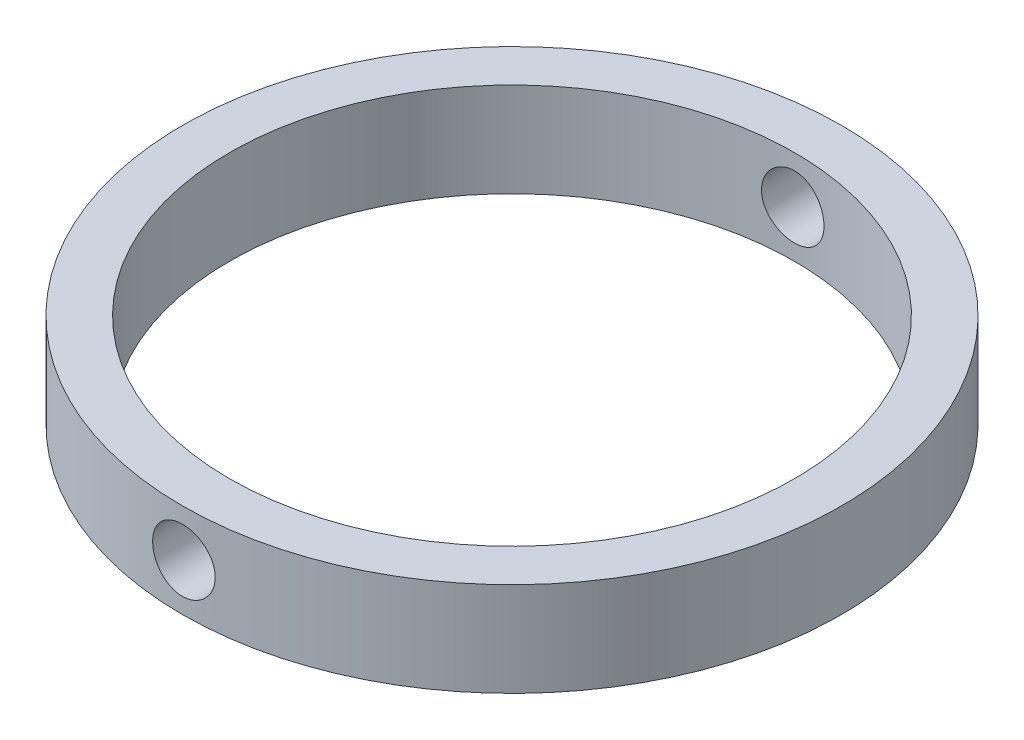
ISO-10303-21;
HEADER;
FILE_DESCRIPTION(('STEP AP214'),'2;1');
FILE_NAME('part.step','',(''),(''),'','','');
FILE_SCHEMA(('AUTOMOTIVE_DESIGN { 1 0 10303 214 1 1 1 1 }'));
ENDSEC;
DATA;
#1=APPLICATION_CONTEXT('core data for automotive mechanical design processes');
#2=APPLICATION_PROTOCOL_DEFINITION('international standard','automotive_design',2000,#1);
#3=PRODUCT_CONTEXT('',#1,'mechanical');
#4=PRODUCT('Part','Part','',(#3));
#5=PRODUCT_RELATED_PRODUCT_CATEGORY('part','',(#4));
#6=PRODUCT_DEFINITION_FORMATION('','',#4);
#7=PRODUCT_DEFINITION_CONTEXT('part definition',#1,'design');
#8=PRODUCT_DEFINITION('design','',#6,#7);
#9=PRODUCT_DEFINITION_SHAPE('','',#8);
#10=(LENGTH_UNIT() NAMED_UNIT(*) SI_UNIT(.MILLI.,.METRE.));
#11=(NAMED_UNIT(*) PLANE_ANGLE_UNIT() SI_UNIT($,.RADIAN.));
#12=(NAMED_UNIT(*) SI_UNIT($,.STERADIAN.) SOLID_ANGLE_UNIT());
#13=UNCERTAINTY_MEASURE_WITH_UNIT(LENGTH_MEASURE(1.E-05),#10,'distance_accuracy_value','');
#14=(GEOMETRIC_REPRESENTATION_CONTEXT(3) GLOBAL_UNCERTAINTY_ASSIGNED_CONTEXT((#13)) GLOBAL_UNIT_ASSIGNED_CONTEXT((#10,
#11,#12)) REPRESENTATION_CONTEXT('',''));
#15=CARTESIAN_POINT('',(0.,0.,0.));
#16=DIRECTION('',(0.,0.,1.));
#17=DIRECTION('',(1.,0.,0.));
#18=AXIS2_PLACEMENT_3D('',#15,#16,#17);
#19=CARTESIAN_POINT('',(0.,12.7,0.));
#20=DIRECTION('',(0.,1.,0.));
#21=DIRECTION('',(0.,0.,1.));
#22=AXIS2_PLACEMENT_3D('',#19,#20,#21);
#23=PLANE('',#22);
#24=CARTESIAN_POINT('',(0.,12.7,0.));
#25=DIRECTION('',(0.,1.,0.));
#26=DIRECTION('',(0.,0.,1.));
#27=AXIS2_PLACEMENT_3D('',#24,#25,#26);
#28=CIRCLE('',#27,44.45);
#29=CARTESIAN_POINT('',(0.,12.7,44.45));
#30=VERTEX_POINT('',#29);
#31=EDGE_CURVE('E10',#30,#30,#28,.T.);
#32=ORIENTED_EDGE('',*,*,#31,.T.);
#33=EDGE_LOOP('',(#32));
#34=FACE_BOUND('',#33,.T.);
#35=CARTESIAN_POINT('',(0.,12.7,0.));
#36=DIRECTION('',(0.,1.,0.));
#37=DIRECTION('',(0.,0.,1.));
#38=AXIS2_PLACEMENT_3D('',#35,#36,#37);
#39=CIRCLE('',#38,38.1);
#40=CARTESIAN_POINT('',(0.,12.7,38.1));
#41=VERTEX_POINT('',#40);
#42=EDGE_CURVE('E57',#41,#41,#39,.T.);
#43=ORIENTED_EDGE('',*,*,#42,.F.);
#44=EDGE_LOOP('',(#43));
#45=FACE_BOUND('',#44,.T.);
#46=ADVANCED_FACE('F36',(#34,#45),#23,.T.);
#47=CARTESIAN_POINT('',(0.,0.,0.));
#48=DIRECTION('',(0.,1.,0.));
#49=DIRECTION('',(0.,0.,1.));
#50=AXIS2_PLACEMENT_3D('',#47,#48,#49);
#51=PLANE('',#50);
#52=CARTESIAN_POINT('',(0.,0.,0.));
#53=DIRECTION('',(0.,1.,0.));
#54=DIRECTION('',(0.,0.,1.));
#55=AXIS2_PLACEMENT_3D('',#52,#53,#54);
#56=CIRCLE('',#55,44.45);
#57=CARTESIAN_POINT('',(0.,0.,44.45));
#58=VERTEX_POINT('',#57);
#59=EDGE_CURVE('E51',#58,#58,#56,.T.);
#60=ORIENTED_EDGE('',*,*,#59,.F.);
#61=EDGE_LOOP('',(#60));
#62=FACE_BOUND('',#61,.T.);
#63=CARTESIAN_POINT('',(0.,0.,0.));
#64=DIRECTION('',(0.,1.,0.));
#65=DIRECTION('',(0.,0.,1.));
#66=AXIS2_PLACEMENT_3D('',#63,#64,#65);
#67=CIRCLE('',#66,38.1);
#68=CARTESIAN_POINT('',(0.,0.,38.1));
#69=VERTEX_POINT('',#68);
#70=EDGE_CURVE('E60',#69,#69,#67,.T.);
#71=ORIENTED_EDGE('',*,*,#70,.T.);
#72=EDGE_LOOP('',(#71));
#73=FACE_BOUND('',#72,.T.);
#74=ADVANCED_FACE('F101',(#62,#73),#51,.F.);
#75=CARTESIAN_POINT('',(0.,12.7,0.));
#76=DIRECTION('',(0.,-1.,0.));
#77=DIRECTION('',(0.,0.,-1.));
#78=AXIS2_PLACEMENT_3D('',#75,#76,#77);
#79=CYLINDRICAL_SURFACE('',#78,44.45);
#80=CARTESIAN_POINT('',(0.,10.5664,-44.45));
#81=CARTESIAN_POINT('',(-0.236267415471575,10.5663897384472,-44.4499974073842));
#82=CARTESIAN_POINT('',(-0.472692559272947,10.5464741705039,-44.4480961950543));
#83=CARTESIAN_POINT('',(-0.938992554108577,10.4673252725403,-44.4406946926994));
#84=CARTESIAN_POINT('',(-1.16885982473847,10.4080482228805,-44.4351904007534));
#85=CARTESIAN_POINT('',(-1.61522375473285,10.251913743613,-44.421204296696));
#86=CARTESIAN_POINT('',(-1.83172823497933,10.1550785422395,-44.4127242460252));
#87=CARTESIAN_POINT('',(-2.24536175924222,9.92661862148092,-44.3937357507287));
#88=CARTESIAN_POINT('',(-2.44249474025468,9.79500099130006,-44.3832277195548));
#89=CARTESIAN_POINT('',(-2.81247976536595,9.5002517887224,-44.3613227811777));
#90=CARTESIAN_POINT('',(-2.98525994915932,9.3370301895989,-44.3499233915214));
#91=CARTESIAN_POINT('',(-3.30101746906274,8.98389785311745,-44.3275411430917));
#92=CARTESIAN_POINT('',(-3.44399344990457,8.79398590274267,-44.3165583032784));
#93=CARTESIAN_POINT('',(-3.69633521394845,8.39241829275067,-44.2962269303615));
#94=CARTESIAN_POINT('',(-3.80563652210844,8.18072194441219,-44.2868815469726));
#95=CARTESIAN_POINT('',(-3.98711454606251,7.74187741474775,-44.2709133152361));
#96=CARTESIAN_POINT('',(-4.05929209294597,7.51472957946303,-44.2642904059412));
#97=CARTESIAN_POINT('',(-4.16426204514671,7.05215919489345,-44.2545389874999));
#98=CARTESIAN_POINT('',(-4.19717303435327,6.81676378100518,-44.251399959146));
#99=CARTESIAN_POINT('',(-4.2230421416041,6.34377094156487,-44.2489388904733));
#100=CARTESIAN_POINT('',(-4.21600121113458,6.10617356858875,-44.2496167592522));
#101=CARTESIAN_POINT('',(-4.16226416859741,5.6363371907643,-44.2547033011662));
#102=CARTESIAN_POINT('',(-4.1156973357785,5.40408324958401,-44.2590998113994));
#103=CARTESIAN_POINT('',(-3.98443140523906,4.9507024278025,-44.2711092387397));
#104=CARTESIAN_POINT('',(-3.8997318389731,4.72957568396075,-44.278722195368));
#105=CARTESIAN_POINT('',(-3.69446138117916,4.3043166630584,-44.2963207297735));
#106=CARTESIAN_POINT('',(-3.57383292159806,4.10021233756615,-44.3063101100306));
#107=CARTESIAN_POINT('',(-3.3001702848931,3.71509772782045,-44.327532636197));
#108=CARTESIAN_POINT('',(-3.14713525496195,3.53408805152384,-44.3387658148343));
#109=CARTESIAN_POINT('',(-2.81228052925195,3.19954955481987,-44.3612644186416));
#110=CARTESIAN_POINT('',(-2.63034914711091,3.04613250086105,-44.3725297951499));
#111=CARTESIAN_POINT('',(-2.24325449654987,2.77199977558464,-44.3937813118789));
#112=CARTESIAN_POINT('',(-2.03809120587651,2.65128413559145,-44.4037674508741));
#113=CARTESIAN_POINT('',(-1.61028070276354,2.44598620612768,-44.4213381353344));
#114=CARTESIAN_POINT('',(-1.38763086668425,2.36140935114199,-44.4289223195535));
#115=CARTESIAN_POINT('',(-0.93120295572557,2.23087052885905,-44.4408307447667));
#116=CARTESIAN_POINT('',(-0.697425180381823,2.18490752279617,-44.4451550734552));
#117=CARTESIAN_POINT('',(-0.226345669540992,2.13304236448127,-44.450045293813));
#118=CARTESIAN_POINT('',(0.0109389362251417,2.12698593405985,-44.4506256593997));
#119=CARTESIAN_POINT('',(0.483146782814933,2.15470098419586,-44.4480013226996));
#120=CARTESIAN_POINT('',(0.718070052257769,2.1884719814601,-44.4447966663428));
#121=CARTESIAN_POINT('',(1.17844309403234,2.29475529993276,-44.4349717736446));
#122=CARTESIAN_POINT('',(1.40390963514649,2.36719562250853,-44.4283578857543));
#123=CARTESIAN_POINT('',(1.83948970253199,2.54868743486622,-44.4124568378296));
#124=CARTESIAN_POINT('',(2.04960291735029,2.65773966709564,-44.4031696235837));
#125=CARTESIAN_POINT('',(2.44921102585819,2.90974398486231,-44.3829254241447));
#126=CARTESIAN_POINT('',(2.63864156688343,3.05279771002466,-44.3719634684868));
#127=CARTESIAN_POINT('',(2.99085627405913,3.36859815378952,-44.3496165112102));
#128=CARTESIAN_POINT('',(3.15363983919278,3.54134554194611,-44.3382315000565));
#129=CARTESIAN_POINT('',(3.44847332360649,3.91230161107442,-44.3162782692328));
#130=CARTESIAN_POINT('',(3.58042217776363,4.11059080416726,-44.3057128092991));
#131=CARTESIAN_POINT('',(3.80914652202358,4.52660348165217,-44.2866360391985));
#132=CARTESIAN_POINT('',(3.90592245113895,4.74432672343496,-44.2781247033935));
#133=CARTESIAN_POINT('',(4.06138366430292,5.19267685038463,-44.2641365797924));
#134=CARTESIAN_POINT('',(4.12012964929062,5.42328253103547,-44.2586549582179));
#135=CARTESIAN_POINT('',(4.19806057113947,5.89113914317199,-44.2513315492881));
#136=CARTESIAN_POINT('',(4.21724651901916,6.12838990467518,-44.2494896689137));
#137=CARTESIAN_POINT('',(4.21549950028008,6.60179755041262,-44.2496560591716));
#138=CARTESIAN_POINT('',(4.19472530258023,6.83795504201636,-44.2516490930029));
#139=CARTESIAN_POINT('',(4.11397999073528,7.30340965466367,-44.2592282974809));
#140=CARTESIAN_POINT('',(4.05400882687629,7.53270676700577,-44.2648144726848));
#141=CARTESIAN_POINT('',(3.89661461317422,7.97793421943929,-44.2789463855722));
#142=CARTESIAN_POINT('',(3.79919565162955,8.19386601567923,-44.2874918001759));
#143=CARTESIAN_POINT('',(3.56968794715809,8.60633768017529,-44.3065799800281));
#144=CARTESIAN_POINT('',(3.43759951251657,8.80287772084393,-44.3171227275158));
#145=CARTESIAN_POINT('',(3.1419056085254,9.17180037589786,-44.3390677625476));
#146=CARTESIAN_POINT('',(2.9781819925191,9.34408811081044,-44.3504731714953));
#147=CARTESIAN_POINT('',(2.62409419607462,9.65881735779169,-44.3728298637013));
#148=CARTESIAN_POINT('',(2.43372362328395,9.80125168777548,-44.3837810371732));
#149=CARTESIAN_POINT('',(2.03127397809496,10.0524824878628,-44.404021033267));
#150=CARTESIAN_POINT('',(1.81914599205878,10.1612008519805,-44.413305975278));
#151=CARTESIAN_POINT('',(1.37969618953959,10.3413323742876,-44.4291242546678));
#152=CARTESIAN_POINT('',(1.152391946267,10.4127878637194,-44.435660712727));
#153=CARTESIAN_POINT('',(0.769819014773978,10.4984225165445,-44.4435914298163));
#154=CARTESIAN_POINT('',(0.61700096007311,10.5238795555171,-44.4459835247038));
#155=CARTESIAN_POINT('',(0.309477827288354,10.5578716276529,-44.4491886561155));
#156=CARTESIAN_POINT('',(0.154772756038388,10.5664067220814,-44.4500016983564));
#157=CARTESIAN_POINT('',(0.,10.5664,-44.45));
#158=B_SPLINE_CURVE_WITH_KNOTS('',3,(#80,#81,#82,#83,#84,#85,#86,#87,#88,#89,#90,#91,#92,#93,
#94,#95,#96,#97,#98,#99,#100,#101,#102,#103,#104,#105,#106,#107,#108,#109,#110,#111,#112,#113,
#114,#115,#116,#117,#118,#119,#120,#121,#122,#123,#124,#125,#126,#127,#128,#129,#130,#131,#132,
#133,#134,#135,#136,#137,#138,#139,#140,#141,#142,#143,#144,#145,#146,#147,#148,#149,#150,#151,
#152,#153,#154,#155,#156,#157),.UNSPECIFIED.,.T.,.F.,(4,2,2,2,2,2,2,2,2,2,2,2,2,2,2,2,2,2,2,2,2,
2,2,2,2,2,2,2,2,2,2,2,2,2,2,2,2,2,4),(0.,0.708237101528883,1.41726217594416,2.12586826314579,
2.83433003655926,3.54484043288122,4.25538313076177,4.96727793026319,5.67915679188719,
6.38888031350259,7.0985869325685,7.80598118569823,8.51338413097659,9.22192668591969,
9.93048788909828,10.6418575367263,11.3532278657668,12.0647051317701,12.7761632574438,
13.4848692756802,14.1935666940825,14.9009491638729,15.6083459794344,16.3178845956038,
17.0274392130597,17.7392878604399,18.4511276225413,19.161828372189,19.8725109585438,
20.580375705345,21.2882413499397,21.9960297364679,22.703811829467,23.414290204863,
24.1249393103238,24.8372226068063,25.548694965215,26.012644701052,26.4765927571709),.UNSPECIFIED.);
#159=CARTESIAN_POINT('',(0.,10.5664,-44.45));
#160=VERTEX_POINT('',#159);
#161=EDGE_CURVE('E87',#160,#160,#158,.T.);
#162=ORIENTED_EDGE('',*,*,#161,.T.);
#163=EDGE_LOOP('',(#162));
#164=FACE_BOUND('',#163,.T.);
#165=CARTESIAN_POINT('',(4.21640000000001,6.35,44.2495702921509));
#166=CARTESIAN_POINT('',(4.21638973602945,6.11373528079289,44.2495729282274));
#167=CARTESIAN_POINT('',(4.1964746072699,5.87731282468172,44.2514829330157));
#168=CARTESIAN_POINT('',(4.11732761238414,5.41101841420253,44.2589158487923));
#169=CARTESIAN_POINT('',(4.05805201731471,5.18115404234987,44.2644427780356));
#170=CARTESIAN_POINT('',(3.90192179322848,4.73479624165229,44.2784779834654));
#171=CARTESIAN_POINT('',(3.80508946163474,4.51829496737932,44.2869844903877));
#172=CARTESIAN_POINT('',(3.5766362988732,4.10466681419434,44.3060181950927));
#173=CARTESIAN_POINT('',(3.44502254985656,3.90753600228885,44.3165449813891));
#174=CARTESIAN_POINT('',(3.15027726659361,3.53754852485558,44.3384719107303));
#175=CARTESIAN_POINT('',(2.98705483864121,3.36476440739244,44.3498745137978));
#176=CARTESIAN_POINT('',(2.6339191932589,3.0489992963057,44.3722459014338));
#177=CARTESIAN_POINT('',(2.44400477354147,2.90601964588563,44.3832146664324));
#178=CARTESIAN_POINT('',(2.04243500294708,2.65367404689,44.4035065143933));
#179=CARTESIAN_POINT('',(1.83073938796544,2.54437189875361,44.4128264596999));
#180=CARTESIAN_POINT('',(1.39189645232421,2.36289211951214,44.428743867791));
#181=CARTESIAN_POINT('',(1.16474947355071,2.29071366728834,44.4353413907906));
#182=CARTESIAN_POINT('',(0.70218169904897,2.18574181983657,44.4450533464983));
#183=CARTESIAN_POINT('',(0.466788055384097,2.15282976272017,44.4481782713228));
#184=CARTESIAN_POINT('',(-0.00620131890121184,2.12695790632943,44.4506285815197));
#185=CARTESIAN_POINT('',(-0.243796997581854,2.13399716709849,44.4499540562839));
#186=CARTESIAN_POINT('',(-0.713640747162647,2.18773156914064,44.4448900765941));
#187=CARTESIAN_POINT('',(-0.945903557871978,2.23429911185492,44.4405125756209));
#188=CARTESIAN_POINT('',(-1.39930175229695,2.36556953777777,44.4285484752343));
#189=CARTESIAN_POINT('',(-1.62043700393757,2.45027287350833,44.4209618377412));
#190=CARTESIAN_POINT('',(-2.04570632631588,2.65555112999077,44.4034120320531));
#191=CARTESIAN_POINT('',(-2.24981287283085,2.77618273827405,44.3934451132181));
#192=CARTESIAN_POINT('',(-2.63493058864312,3.04985209191655,44.3722536749018));
#193=CARTESIAN_POINT('',(-2.8159411487862,3.20289069172378,44.3610291222652));
#194=CARTESIAN_POINT('',(-3.15047560175027,3.53774794571337,44.3385304713788));
#195=CARTESIAN_POINT('',(-3.30388844925261,3.71967755838745,44.3272563520813));
#196=CARTESIAN_POINT('',(-3.57801353111324,4.1067671713157,44.3059734502032));
#197=CARTESIAN_POINT('',(-3.69872572547507,4.31192719998275,44.2959646691704));
#198=CARTESIAN_POINT('',(-3.90402117774776,4.73973682773999,44.2783444703617));
#199=CARTESIAN_POINT('',(-3.98859793563192,4.96238956489067,44.2707334839649));
#200=CARTESIAN_POINT('',(-4.11913567434889,5.4188237804598,44.2587794244352));
#201=CARTESIAN_POINT('',(-4.16509771149929,5.65260495427157,44.2544362619105));
#202=CARTESIAN_POINT('',(-4.21695921653355,6.12368603279297,44.2495247882155));
#203=CARTESIAN_POINT('',(-4.22301387330858,6.36096870652756,44.2489418547317));
#204=CARTESIAN_POINT('',(-4.19529596552448,6.83317226266293,44.2515782542478));
#205=CARTESIAN_POINT('',(-4.16152388428594,7.06809317369019,44.2547975411056));
#206=CARTESIAN_POINT('',(-4.05524085348508,7.5284545512267,44.2646623385021));
#207=CARTESIAN_POINT('',(-3.98280296966384,7.75391203661279,44.2713013859844));
#208=CARTESIAN_POINT('',(-3.80131906849108,8.18947507183309,44.2872523745898));
#209=CARTESIAN_POINT('',(-3.69227229432317,8.39958030418048,44.2965643709703));
#210=CARTESIAN_POINT('',(-3.4402759995873,8.79918299250565,44.3168474503499));
#211=CARTESIAN_POINT('',(-3.29722345250121,8.98861522028401,44.3278235376712));
#212=CARTESIAN_POINT('',(-2.98142438529609,9.34083387967477,44.3501815220167));
#213=CARTESIAN_POINT('',(-2.8086772038021,9.50361971764666,44.3615634280751));
#214=CARTESIAN_POINT('',(-2.4377201385341,9.7984580868046,44.3834945462008));
#215=CARTESIAN_POINT('',(-2.23942970672199,9.93040951299845,44.3940409459833));
#216=CARTESIAN_POINT('',(-1.82341386849594,10.1591383705573,44.4130719566641));
#217=CARTESIAN_POINT('',(-1.60568870508089,10.2559162416322,44.4215565933364));
#218=CARTESIAN_POINT('',(-1.15733981273607,10.4113787448699,44.4354953140861));
#219=CARTESIAN_POINT('',(-0.926737581575844,10.4701249193368,44.4409542921673));
#220=CARTESIAN_POINT('',(-0.458888242337908,10.5480573890922,44.4482466328051));
#221=CARTESIAN_POINT('',(-0.221641301138878,10.5672446769816,44.4500800863323));
#222=CARTESIAN_POINT('',(0.251768665723816,10.565501556171,44.4499148133699));
#223=CARTESIAN_POINT('',(0.487932291063981,10.5447283012362,44.4479310987377));
#224=CARTESIAN_POINT('',(0.953399405953707,10.4639827166761,44.4403840104014));
#225=CARTESIAN_POINT('',(1.18270288870175,10.404010348188,44.4348206331484));
#226=CARTESIAN_POINT('',(1.62794307069406,10.2466113338626,44.4207378270969));
#227=CARTESIAN_POINT('',(1.84388120735542,10.1491887238809,44.4122187168351));
#228=CARTESIAN_POINT('',(2.25636402942652,9.91967176049708,44.3931752016856));
#229=CARTESIAN_POINT('',(2.45290889117624,9.78757772239671,44.3826508150341));
#230=CARTESIAN_POINT('',(2.82183123753579,9.49187766687309,44.3607270648264));
#231=CARTESIAN_POINT('',(2.99411486543789,9.32815478357003,44.3493245536713));
#232=CARTESIAN_POINT('',(3.30883616850797,8.97407014078955,44.3269564255338));
#233=CARTESIAN_POINT('',(3.45126665084649,8.78370197977229,44.3159909143567));
#234=CARTESIAN_POINT('',(3.70249332327853,8.38125428819272,44.2957110135582));
#235=CARTESIAN_POINT('',(3.8112107127737,8.16912541041943,44.2864005136798));
#236=CARTESIAN_POINT('',(3.99134016572257,7.72967371400221,44.2705314544183));
#237=CARTESIAN_POINT('',(4.06279457385993,7.50236847432347,44.2639697730253));
#238=CARTESIAN_POINT('',(4.14842617101243,7.11979843739268,44.2560068335103));
#239=CARTESIAN_POINT('',(4.17388183476903,6.966984489713,44.2536044398081));
#240=CARTESIAN_POINT('',(4.20787207992378,6.65946958552979,44.2503853086446));
#241=CARTESIAN_POINT('',(4.216406723563,6.50476863596939,44.2495685653506));
#242=CARTESIAN_POINT('',(4.21640000000001,6.35,44.2495702921509));
#243=B_SPLINE_CURVE_WITH_KNOTS('',3,(#165,#166,#167,#168,#169,#170,#171,#172,#173,#174,#175,
#176,#177,#178,#179,#180,#181,#182,#183,#184,#185,#186,#187,#188,#189,#190,#191,#192,#193,#194,
#195,#196,#197,#198,#199,#200,#201,#202,#203,#204,#205,#206,#207,#208,#209,#210,#211,#212,#213,
#214,#215,#216,#217,#218,#219,#220,#221,#222,#223,#224,#225,#226,#227,#228,#229,#230,#231,#232,
#233,#234,#235,#236,#237,#238,#239,#240,#241,#242),.UNSPECIFIED.,.T.,.F.,(4,2,2,2,2,2,2,2,2,2,2,
2,2,2,2,2,2,2,2,2,2,2,2,2,2,2,2,2,2,2,2,2,2,2,2,2,2,2,4),(0.,0.708229002739429,1.41724615768521,
2.12584301212795,2.83429569393784,3.54481668813043,4.25536969658685,4.96726065299844,
5.67913586280628,6.38885431318882,7.09855606570479,7.80597555248388,8.51340343377327,
9.22195345980758,9.93052216991352,10.6418811191786,11.3532409385091,12.0647286631188,
12.7761969241284,13.4848968389489,14.1935881533729,14.9009449891652,15.6083164490613,
16.3178589612728,17.0274172788475,17.7392705522483,18.451114926358,19.1618045064634,
19.8724762539204,20.5803588388465,21.288242125583,21.9960491480799,22.7038497340069,
23.4143174097161,24.1249560695263,24.8372434612248,25.5487196544842,26.012657055996,
26.4765927509901),.UNSPECIFIED.);
#244=CARTESIAN_POINT('',(4.21640000000001,6.35,44.2495702921509));
#245=VERTEX_POINT('',#244);
#246=EDGE_CURVE('E81',#245,#245,#243,.T.);
#247=ORIENTED_EDGE('',*,*,#246,.T.);
#248=EDGE_LOOP('',(#247));
#249=FACE_BOUND('',#248,.T.);
#250=ORIENTED_EDGE('',*,*,#31,.F.);
#251=EDGE_LOOP('',(#250));
#252=FACE_BOUND('',#251,.T.);
#253=ORIENTED_EDGE('',*,*,#59,.T.);
#254=EDGE_LOOP('',(#253));
#255=FACE_BOUND('',#254,.T.);
#256=ADVANCED_FACE('F38',(#164,#249,#252,#255),#79,.T.);
#257=CARTESIAN_POINT('',(0.,12.7,0.));
#258=DIRECTION('',(0.,-1.,0.));
#259=DIRECTION('',(0.,0.,-1.));
#260=AXIS2_PLACEMENT_3D('',#257,#258,#259);
#261=CYLINDRICAL_SURFACE('',#260,38.1);
#262=CARTESIAN_POINT('',(0.,10.5664,-38.1));
#263=CARTESIAN_POINT('',(-0.236062689641896,10.5663898500043,-38.099997028313));
#264=CARTESIAN_POINT('',(-0.47227803678269,10.5465086268052,-38.0977828231283));
#265=CARTESIAN_POINT('',(-0.938150221169288,10.4675041322447,-38.0891628595749));
#266=CARTESIAN_POINT('',(-1.16779970449149,10.4083385292164,-38.0827525797478));
#267=CARTESIAN_POINT('',(-1.61372714312862,10.2525172215382,-38.0664634924003));
#268=CARTESIAN_POINT('',(-1.83001344577672,10.1558852005375,-38.0565868764285));
#269=CARTESIAN_POINT('',(-2.24325305212371,9.9279224807822,-38.0344671313534));
#270=CARTESIAN_POINT('',(-2.4402099786112,9.79659830126918,-38.0222244469902));
#271=CARTESIAN_POINT('',(-2.8101039311943,9.50236529177752,-37.9966824434775));
#272=CARTESIAN_POINT('',(-2.98294462933587,9.33933569216961,-37.9833792026562));
#273=CARTESIAN_POINT('',(-3.29887114766294,8.98657813441277,-37.9572475435519));
#274=CARTESIAN_POINT('',(-3.44195553748917,8.79684889357052,-37.9444191481186));
#275=CARTESIAN_POINT('',(-3.69465674120495,8.3954646962267,-37.9206503213937));
#276=CARTESIAN_POINT('',(-3.80418504416474,8.1837536923503,-37.9097149156961));
#277=CARTESIAN_POINT('',(-3.98609979651032,7.74480294203007,-37.8910203193249));
#278=CARTESIAN_POINT('',(-4.05848735820429,7.51756366086529,-37.8832610335328));
#279=CARTESIAN_POINT('',(-4.16377707678959,7.05499724793262,-37.8718336292417));
#280=CARTESIAN_POINT('',(-4.19684032203391,6.81970720246535,-37.8681488244113));
#281=CARTESIAN_POINT('',(-4.2230410248092,6.34689106724216,-37.8652361403404));
#282=CARTESIAN_POINT('',(-4.21617975334477,6.10936504890921,-37.8660081192175));
#283=CARTESIAN_POINT('',(-4.16285873858841,5.63993475011679,-37.8719065216169));
#284=CARTESIAN_POINT('',(-4.11657549964146,5.40801014280283,-37.8770135354981));
#285=CARTESIAN_POINT('',(-3.9859992998678,4.95524052137897,-37.8909762867364));
#286=CARTESIAN_POINT('',(-3.90170572226083,4.73439568712123,-37.8998320849236));
#287=CARTESIAN_POINT('',(-3.69730885348687,4.30950070546172,-37.9203168023999));
#288=CARTESIAN_POINT('',(-3.57712789771533,4.10548822003321,-37.9319517250086));
#289=CARTESIAN_POINT('',(-3.30442347136827,3.72046145247045,-37.9566788516255));
#290=CARTESIAN_POINT('',(-3.15189884071078,3.53944799562297,-37.9697711078963));
#291=CARTESIAN_POINT('',(-2.81785390644443,3.20453239585759,-37.9960241701989));
#292=CARTESIAN_POINT('',(-2.6361812863576,3.05078213164087,-38.0091849641292));
#293=CARTESIAN_POINT('',(-2.24952450278268,2.77593664452106,-38.0340256398835));
#294=CARTESIAN_POINT('',(-2.04454030340294,2.65484147189633,-38.0457055194275));
#295=CARTESIAN_POINT('',(-1.61696912332996,2.44874723330736,-38.0662734897611));
#296=CARTESIAN_POINT('',(-1.39437804765851,2.36375659393011,-38.0751609286857));
#297=CARTESIAN_POINT('',(-0.937964462897084,2.232398994076,-38.0891363399417));
#298=CARTESIAN_POINT('',(-0.704142365773639,2.18603061803355,-38.0942244515237));
#299=CARTESIAN_POINT('',(-0.233218532049039,2.13342811497518,-38.1000099510185));
#300=CARTESIAN_POINT('',(0.00385954043177278,2.12698455225129,-38.1007302509663));
#301=CARTESIAN_POINT('',(0.475719026517975,2.15386345730618,-38.0977605765972));
#302=CARTESIAN_POINT('',(0.710500478198958,2.18718526468596,-38.0940706755222));
#303=CARTESIAN_POINT('',(1.17049225543244,2.29247517286842,-38.0827096877054));
#304=CARTESIAN_POINT('',(1.39572546469836,2.36434449036775,-38.0750487788953));
#305=CARTESIAN_POINT('',(1.83094036388712,2.54458732414886,-38.056604478109));
#306=CARTESIAN_POINT('',(2.04092163991146,2.65296183063861,-38.0458210014339));
#307=CARTESIAN_POINT('',(2.44061439591356,2.90365301070789,-38.0222789872727));
#308=CARTESIAN_POINT('',(2.63023963036296,3.04610643846006,-38.0095125668103));
#309=CARTESIAN_POINT('',(2.98296273972481,3.36071670142857,-37.9834605240368));
#310=CARTESIAN_POINT('',(3.14605979533577,3.53287445370085,-37.9701748857056));
#311=CARTESIAN_POINT('',(3.44183039031272,3.90292382047592,-37.9445121247961));
#312=CARTESIAN_POINT('',(3.57436591725347,4.10092608436498,-37.9321392888145));
#313=CARTESIAN_POINT('',(3.80430063706225,4.5165017215011,-37.9097704968815));
#314=CARTESIAN_POINT('',(3.90170040222856,4.7340747759031,-37.8997745022166));
#315=CARTESIAN_POINT('',(4.05837075428589,5.18215381033598,-37.8833190412972));
#316=CARTESIAN_POINT('',(4.11772173166042,5.41263139676908,-37.8768521230492));
#317=CARTESIAN_POINT('',(4.19686985091603,5.88035664334315,-37.8681646564272));
#318=CARTESIAN_POINT('',(4.2166684066317,6.1176040611833,-37.8659439562688));
#319=CARTESIAN_POINT('',(4.216127539349,6.59076221099756,-37.8660040747809));
#320=CARTESIAN_POINT('',(4.19600491240055,6.82667322359454,-37.8682605795419));
#321=CARTESIAN_POINT('',(4.11664926127609,7.29174012549078,-37.8769688456693));
#322=CARTESIAN_POINT('',(4.05741620733328,7.5208960096486,-37.8834206102287));
#323=CARTESIAN_POINT('',(3.90158420865352,7.96593520511576,-37.8997853947802));
#324=CARTESIAN_POINT('',(3.80499329337743,8.18182135698906,-37.9096976709474));
#325=CARTESIAN_POINT('',(3.57720917985188,8.59435362505786,-37.9318680218083));
#326=CARTESIAN_POINT('',(3.44601592227596,8.79099970826504,-37.9441261005238));
#327=CARTESIAN_POINT('',(3.15194028406694,9.16058017436625,-37.9696866996019));
#328=CARTESIAN_POINT('',(2.98889619205145,9.33338553523667,-37.9829943339759));
#329=CARTESIAN_POINT('',(2.6360765760799,9.64927291460849,-38.0091084223427));
#330=CARTESIAN_POINT('',(2.44629470130579,9.79234785143303,-38.0219147563393));
#331=CARTESIAN_POINT('',(2.0447448898827,10.0450662365606,-38.0456247304567));
#332=CARTESIAN_POINT('',(1.83291229230789,10.1546074268972,-38.0565225082221));
#333=CARTESIAN_POINT('',(1.39386736887987,10.3364136269557,-38.0751259270575));
#334=CARTESIAN_POINT('',(1.16667245278786,10.4087200587826,-38.0828351134135));
#335=CARTESIAN_POINT('',(0.781861736268021,10.4962612719381,-38.0922869213156));
#336=CARTESIAN_POINT('',(0.626693361908288,10.5225266214983,-38.0951655988565));
#337=CARTESIAN_POINT('',(0.314372556041646,10.5575993189681,-38.0990231227186));
#338=CARTESIAN_POINT('',(0.15722013512231,10.5664067599996,-38.1000019791736));
#339=CARTESIAN_POINT('',(0.,10.5664,-38.1));
#340=B_SPLINE_CURVE_WITH_KNOTS('',3,(#262,#263,#264,#265,#266,#267,#268,#269,#270,#271,#272,
#273,#274,#275,#276,#277,#278,#279,#280,#281,#282,#283,#284,#285,#286,#287,#288,#289,#290,#291,
#292,#293,#294,#295,#296,#297,#298,#299,#300,#301,#302,#303,#304,#305,#306,#307,#308,#309,#310,
#311,#312,#313,#314,#315,#316,#317,#318,#319,#320,#321,#322,#323,#324,#325,#326,#327,#328,#329,
#330,#331,#332,#333,#334,#335,#336,#337,#338,#339),.UNSPECIFIED.,.T.,.F.,(4,2,2,2,2,2,2,2,2,2,2,
2,2,2,2,2,2,2,2,2,2,2,2,2,2,2,2,2,2,2,2,2,2,2,2,2,2,2,4),(0.,0.70761389482133,1.41599153327068,
2.1239221130605,2.83171975527089,3.54226824193688,4.25285087614598,4.96529199079352,
5.67771176767801,6.38720302084685,7.09667168735012,7.80298044057771,8.5093006552387,
9.2171606484814,9.9250460350834,10.6367588552264,11.3484727711722,12.0603527058435,
12.7722065478678,13.4803229969056,14.1884276861413,14.8947263694727,15.6010442127901,
16.3102454177801,17.0194685217223,17.7318342737132,18.4441884220248,19.1550324857054,
19.8658511392119,20.5728201856719,21.2797897702037,21.9866074875617,22.6934264167821,
23.4039318861649,24.1146064018085,24.8274269466589,25.5394527861495,26.0107332996215,
26.4820112992367),.UNSPECIFIED.);
#341=CARTESIAN_POINT('',(0.,10.5664,-38.1));
#342=VERTEX_POINT('',#341);
#343=EDGE_CURVE('E41',#342,#342,#340,.T.);
#344=ORIENTED_EDGE('',*,*,#343,.F.);
#345=EDGE_LOOP('',(#344));
#346=FACE_BOUND('',#345,.T.);
#347=CARTESIAN_POINT('',(4.21640000000001,6.35,37.8659737896703));
#348=CARTESIAN_POINT('',(4.21638984556868,6.11394230088964,37.8659768295497));
#349=CARTESIAN_POINT('',(4.19650943457258,5.87773192900172,37.8682049826151));
#350=CARTESIAN_POINT('',(4.11750845931761,5.41187008150031,37.8768747673368));
#351=CARTESIAN_POINT('',(4.05834554599679,5.18222596372741,37.8833209461872));
#352=CARTESIAN_POINT('',(3.90253210611046,4.73630987204861,37.899687882006));
#353=CARTESIAN_POINT('',(3.80590539094456,4.52002950538119,37.9096064316027));
#354=CARTESIAN_POINT('',(3.57795516716073,4.10679985050303,37.9317978492328));
#355=CARTESIAN_POINT('',(3.44663816481451,3.90984694685616,37.9440702756711));
#356=CARTESIAN_POINT('',(3.15241241457464,3.53994847369692,37.9696473996384));
#357=CARTESIAN_POINT('',(2.98938129272811,3.36710050113983,37.9829559719964));
#358=CARTESIAN_POINT('',(2.63661763319054,3.05115993677761,38.0090708211134));
#359=CARTESIAN_POINT('',(2.44688383268952,2.90806875300932,38.0218770740802));
#360=CARTESIAN_POINT('',(2.04549561847334,2.65536042748771,38.0455832937697));
#361=CARTESIAN_POINT('',(1.83378594162614,2.54583055368521,38.0564782597715));
#362=CARTESIAN_POINT('',(1.39483807491603,2.36391253142081,38.0750919786941));
#363=CARTESIAN_POINT('',(1.1676003426068,2.29152328909784,38.0828108251563));
#364=CARTESIAN_POINT('',(0.705038760245823,2.1862300843415,38.0941753578226));
#365=CARTESIAN_POINT('',(0.469752029338659,2.15316487786405,38.0978376731289));
#366=CARTESIAN_POINT('',(-0.0030576094870517,2.12695910412455,38.1007331554606));
#367=CARTESIAN_POINT('',(-0.240580447184057,2.13381728727685,38.0999664611123));
#368=CARTESIAN_POINT('',(-0.710024320243367,2.18713339553772,38.0941038557229));
#369=CARTESIAN_POINT('',(-0.94196531847093,2.23341792569663,38.0890269012988));
#370=CARTESIAN_POINT('',(-1.39476705442603,2.36400238277681,38.0751358120478));
#371=CARTESIAN_POINT('',(-1.6156276208756,2.4483028971366,38.0663216194717));
#372=CARTESIAN_POINT('',(-2.04054173917129,2.65271416366544,38.0459140988149));
#373=CARTESIAN_POINT('',(-2.24455841067484,2.77290096772614,38.0343148789035));
#374=CARTESIAN_POINT('',(-2.62959107350249,3.04561789474248,38.0096373252868));
#375=CARTESIAN_POINT('',(-2.8106062375084,3.19814918053808,37.9965589384107));
#376=CARTESIAN_POINT('',(-3.14551438342377,3.53219885636943,37.9703063953695));
#377=CARTESIAN_POINT('',(-3.29925682849962,3.71386819883431,37.9571321015589));
#378=CARTESIAN_POINT('',(-3.57408809810016,4.10051563122484,37.9322421847659));
#379=CARTESIAN_POINT('',(-3.69517685601861,4.30549376869402,37.9205265647588));
#380=CARTESIAN_POINT('',(-3.90126647178015,4.73306326294228,37.8998799812362));
#381=CARTESIAN_POINT('',(-3.98625692977208,4.9556596736296,37.8909498204026));
#382=CARTESIAN_POINT('',(-4.11761253398976,5.41208486123109,37.8769015402293));
#383=CARTESIAN_POINT('',(-4.1639791284183,5.64591321665546,37.871783277963));
#384=CARTESIAN_POINT('',(-4.21657490635655,6.11684003057101,37.8659636779181));
#385=CARTESIAN_POINT('',(-4.22301518966181,6.35391463653784,37.8652391100898));
#386=CARTESIAN_POINT('',(-4.19613096300677,6.82576640337887,37.8682275883863));
#387=CARTESIAN_POINT('',(-4.16280711367987,7.0605436023564,37.8719405607866));
#388=CARTESIAN_POINT('',(-4.05751763483247,7.52051387389518,37.8833646080421));
#389=CARTESIAN_POINT('',(-3.98565278066721,7.74573029564141,37.8910652543002));
#390=CARTESIAN_POINT('',(-3.80542449133042,8.18091359267088,37.909588535823));
#391=CARTESIAN_POINT('',(-3.69706003954784,8.39088004300375,37.9204112580446));
#392=CARTESIAN_POINT('',(-3.44638372268202,8.79056258361028,37.9440152605315));
#393=CARTESIAN_POINT('',(-3.30393255057256,8.98019082468533,37.956804498905));
#394=CARTESIAN_POINT('',(-2.98932502580549,9.33292104998391,37.9828749125276));
#395=CARTESIAN_POINT('',(-2.8171677709175,9.49602222823761,37.9961561027085));
#396=CARTESIAN_POINT('',(-2.44711662839113,9.79180189454387,38.0217846076891));
#397=CARTESIAN_POINT('',(-2.24911199824561,9.924342267346,38.0341275200967));
#398=CARTESIAN_POINT('',(-1.83353032090964,10.1542854867785,38.0564240071091));
#399=CARTESIAN_POINT('',(-1.61595359359461,10.2516889075372,38.0663776207534));
#400=CARTESIAN_POINT('',(-1.16787674588929,10.4083616420365,38.082754278818));
#401=CARTESIAN_POINT('',(-0.937405576982921,10.4677129303838,38.0891849083195));
#402=CARTESIAN_POINT('',(-0.469693878295718,10.5468638455717,38.0978223247239));
#403=CARTESIAN_POINT('',(-0.232453584895525,10.5666648518144,38.1000292589373));
#404=CARTESIAN_POINT('',(0.24070864338259,10.5661312011475,38.0999703039832));
#405=CARTESIAN_POINT('',(0.476630851307645,10.5460103676861,38.0977282438532));
#406=CARTESIAN_POINT('',(0.941720595582915,10.4666543683122,38.0890703447178));
#407=CARTESIAN_POINT('',(1.17088813019074,10.4074191923101,38.0826545046359));
#408=CARTESIAN_POINT('',(1.61595092293847,10.2515784790787,38.0663673411873));
#409=CARTESIAN_POINT('',(1.83184897130929,10.1549808295855,38.0564967472088));
#410=CARTESIAN_POINT('',(2.24440222708718,9.92717955932427,38.0343974267506));
#411=CARTESIAN_POINT('',(2.44105740889371,9.79597589251758,38.0221686971336));
#412=CARTESIAN_POINT('',(2.81063753833609,9.50188872432343,37.9966428017889));
#413=CARTESIAN_POINT('',(2.98343535330539,9.33884589767646,37.9833404687062));
#414=CARTESIAN_POINT('',(3.2993080985096,8.98603192840442,37.9572095342859));
#415=CARTESIAN_POINT('',(3.44237592718393,8.79625441782563,37.9443810467353));
#416=CARTESIAN_POINT('',(3.69508656770004,8.39470824305499,37.9206084385791));
#417=CARTESIAN_POINT('',(3.80462586934418,8.18287412972645,37.9096701979633));
#418=CARTESIAN_POINT('',(3.98642811990485,7.74382600822801,37.8909859835812));
#419=CARTESIAN_POINT('',(4.05873251538757,7.5166294203949,37.8832364623582));
#420=CARTESIAN_POINT('',(4.14626805591545,7.13182413922899,37.8737325845498));
#421=CARTESIAN_POINT('',(4.17253085201504,6.97666327218605,37.870837084576));
#422=CARTESIAN_POINT('',(4.20760015785313,6.66435750200036,37.866956680077));
#423=CARTESIAN_POINT('',(4.21640676277307,6.50721260968039,37.865971765134));
#424=CARTESIAN_POINT('',(4.21640000000001,6.35,37.8659737896703));
#425=B_SPLINE_CURVE_WITH_KNOTS('',3,(#347,#348,#349,#350,#351,#352,#353,#354,#355,#356,#357,
#358,#359,#360,#361,#362,#363,#364,#365,#366,#367,#368,#369,#370,#371,#372,#373,#374,#375,#376,
#377,#378,#379,#380,#381,#382,#383,#384,#385,#386,#387,#388,#389,#390,#391,#392,#393,#394,#395,
#396,#397,#398,#399,#400,#401,#402,#403,#404,#405,#406,#407,#408,#409,#410,#411,#412,#413,#414,
#415,#416,#417,#418,#419,#420,#421,#422,#423,#424),.UNSPECIFIED.,.T.,.F.,(4,2,2,2,2,2,2,2,2,2,2,
2,2,2,2,2,2,2,2,2,2,2,2,2,2,2,2,2,2,2,2,2,2,2,2,2,2,2,4),(0.,0.707598903616308,1.4159618856054,
2.12387537940096,2.83165619595687,3.5422243020671,4.25282602331438,4.96526010937433,
5.67767321171281,6.38715495578171,7.09661449348391,7.80296988080134,8.50933618338488,
9.21721020531024,9.9251096808449,10.636802558433,11.3484968877048,12.0603961159017,
12.7722686502163,13.4803741144212,14.1884678144662,14.8947189848842,15.6009898279058,
16.3101979262213,17.0194275683316,17.7318022554693,18.4441653020683,19.1549885228433,
19.8657869516822,20.5727885838011,21.279790398292,21.9866430362942,22.6934966146745,
23.4039824243715,24.1146377522382,24.8274654066834,25.5394978807278,26.0107558707602,
26.4820112912094),.UNSPECIFIED.);
#426=CARTESIAN_POINT('',(4.21640000000001,6.35,37.8659737896703));
#427=VERTEX_POINT('',#426);
#428=EDGE_CURVE('E62',#427,#427,#425,.T.);
#429=ORIENTED_EDGE('',*,*,#428,.F.);
#430=EDGE_LOOP('',(#429));
#431=FACE_BOUND('',#430,.T.);
#432=ORIENTED_EDGE('',*,*,#42,.T.);
#433=EDGE_LOOP('',(#432));
#434=FACE_BOUND('',#433,.T.);
#435=ORIENTED_EDGE('',*,*,#70,.F.);
#436=EDGE_LOOP('',(#435));
#437=FACE_BOUND('',#436,.T.);
#438=ADVANCED_FACE('F68',(#346,#431,#434,#437),#261,.F.);
#439=CARTESIAN_POINT('',(0.,6.35,-44.45));
#440=DIRECTION('',(0.,0.,1.));
#441=DIRECTION('',(1.,0.,0.));
#442=AXIS2_PLACEMENT_3D('',#439,#440,#441);
#443=CYLINDRICAL_SURFACE('',#442,4.2164);
#444=ORIENTED_EDGE('',*,*,#428,.T.);
#445=EDGE_LOOP('',(#444));
#446=FACE_BOUND('',#445,.T.);
#447=ORIENTED_EDGE('',*,*,#246,.F.);
#448=EDGE_LOOP('',(#447));
#449=FACE_BOUND('',#448,.T.);
#450=ADVANCED_FACE('F74',(#446,#449),#443,.F.);
#451=ORIENTED_EDGE('',*,*,#343,.T.);
#452=EDGE_LOOP('',(#451));
#453=FACE_BOUND('',#452,.T.);
#454=ORIENTED_EDGE('',*,*,#161,.F.);
#455=EDGE_LOOP('',(#454));
#456=FACE_BOUND('',#455,.T.);
#457=ADVANCED_FACE('F71',(#453,#456),#443,.F.);
#458=CLOSED_SHELL('',(#46,#74,#256,#438,#450,#457));
#459=MANIFOLD_SOLID_BREP('B2',#458);
#460=ADVANCED_BREP_SHAPE_REPRESENTATION('',(#18,#459),#14);
#461=SHAPE_DEFINITION_REPRESENTATION(#9,#460);
ENDSEC;
END-ISO-10303-21;
